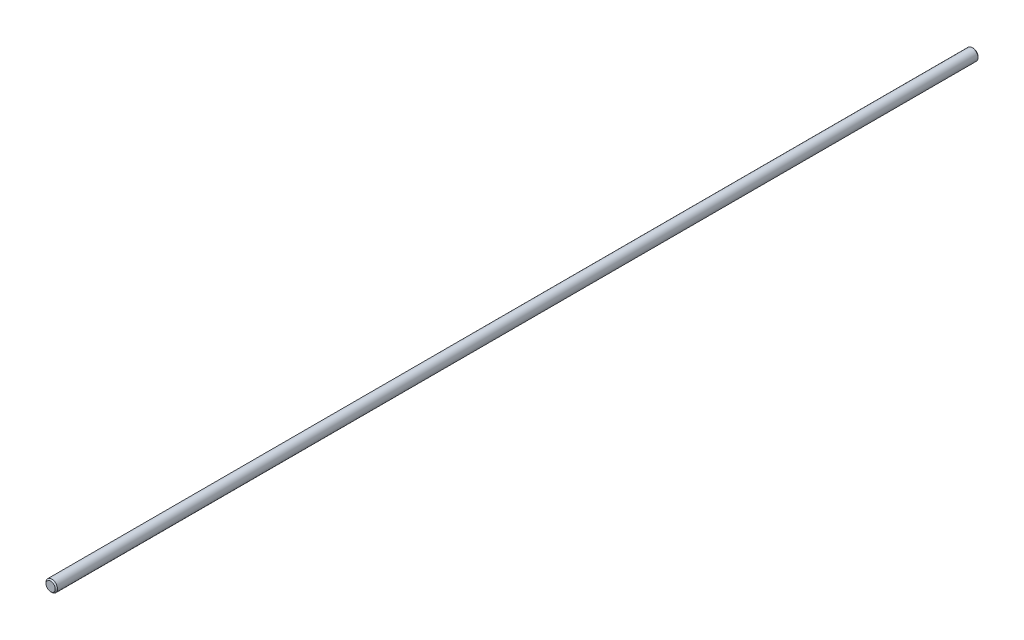
ISO-10303-21;
HEADER;
FILE_DESCRIPTION(('STEP AP214'),'2;1');
FILE_NAME('part.step','',(''),(''),'','','');
FILE_SCHEMA(('AUTOMOTIVE_DESIGN { 1 0 10303 214 1 1 1 1 }'));
ENDSEC;
DATA;
#1=APPLICATION_CONTEXT('core data for automotive mechanical design processes');
#2=APPLICATION_PROTOCOL_DEFINITION('international standard','automotive_design',2000,#1);
#3=PRODUCT_CONTEXT('',#1,'mechanical');
#4=PRODUCT('Part','Part','',(#3));
#5=PRODUCT_RELATED_PRODUCT_CATEGORY('part','',(#4));
#6=PRODUCT_DEFINITION_FORMATION('','',#4);
#7=PRODUCT_DEFINITION_CONTEXT('part definition',#1,'design');
#8=PRODUCT_DEFINITION('design','',#6,#7);
#9=PRODUCT_DEFINITION_SHAPE('','',#8);
#10=(LENGTH_UNIT() NAMED_UNIT(*) SI_UNIT(.MILLI.,.METRE.));
#11=(NAMED_UNIT(*) PLANE_ANGLE_UNIT() SI_UNIT($,.RADIAN.));
#12=(NAMED_UNIT(*) SI_UNIT($,.STERADIAN.) SOLID_ANGLE_UNIT());
#13=UNCERTAINTY_MEASURE_WITH_UNIT(LENGTH_MEASURE(1.E-05),#10,'distance_accuracy_value','');
#14=(GEOMETRIC_REPRESENTATION_CONTEXT(3) GLOBAL_UNCERTAINTY_ASSIGNED_CONTEXT((#13)) GLOBAL_UNIT_ASSIGNED_CONTEXT((#10,
#11,#12)) REPRESENTATION_CONTEXT('',''));
#15=CARTESIAN_POINT('',(0.,0.,0.));
#16=DIRECTION('',(0.,0.,1.));
#17=DIRECTION('',(1.,0.,0.));
#18=AXIS2_PLACEMENT_3D('',#15,#16,#17);
#19=CARTESIAN_POINT('',(0.,0.,200.));
#20=DIRECTION('',(0.,0.,-1.));
#21=DIRECTION('',(-1.,0.,0.));
#22=AXIS2_PLACEMENT_3D('',#19,#20,#21);
#23=CYLINDRICAL_SURFACE('',#22,2.5);
#24=CARTESIAN_POINT('',(0.,0.,-199.5));
#25=DIRECTION('',(0.,0.,1.));
#26=DIRECTION('',(1.,0.,0.));
#27=AXIS2_PLACEMENT_3D('',#24,#25,#26);
#28=CIRCLE('',#27,2.5);
#29=CARTESIAN_POINT('',(2.5,0.,-199.5));
#30=VERTEX_POINT('',#29);
#31=EDGE_CURVE('E41',#30,#30,#28,.T.);
#32=ORIENTED_EDGE('',*,*,#31,.T.);
#33=EDGE_LOOP('',(#32));
#34=FACE_BOUND('',#33,.T.);
#35=CARTESIAN_POINT('',(0.,0.,199.5));
#36=DIRECTION('',(0.,0.,1.));
#37=DIRECTION('',(1.,0.,0.));
#38=AXIS2_PLACEMENT_3D('',#35,#36,#37);
#39=CIRCLE('',#38,2.5);
#40=CARTESIAN_POINT('',(2.5,0.,199.5));
#41=VERTEX_POINT('',#40);
#42=EDGE_CURVE('E45',#41,#41,#39,.F.);
#43=ORIENTED_EDGE('',*,*,#42,.T.);
#44=EDGE_LOOP('',(#43));
#45=FACE_BOUND('',#44,.T.);
#46=ADVANCED_FACE('F30',(#34,#45),#23,.T.);
#47=CARTESIAN_POINT('',(0.,0.,200.));
#48=DIRECTION('',(0.,0.,1.));
#49=DIRECTION('',(1.,0.,0.));
#50=AXIS2_PLACEMENT_3D('',#47,#48,#49);
#51=PLANE('',#50);
#52=CARTESIAN_POINT('',(0.,0.,200.));
#53=DIRECTION('',(0.,0.,1.));
#54=DIRECTION('',(1.,0.,0.));
#55=AXIS2_PLACEMENT_3D('',#52,#53,#54);
#56=CIRCLE('',#55,2.);
#57=CARTESIAN_POINT('',(2.,0.,200.));
#58=VERTEX_POINT('',#57);
#59=EDGE_CURVE('E10',#58,#58,#56,.T.);
#60=ORIENTED_EDGE('',*,*,#59,.T.);
#61=EDGE_LOOP('',(#60));
#62=FACE_BOUND('',#61,.T.);
#63=ADVANCED_FACE('F61',(#62),#51,.T.);
#64=CARTESIAN_POINT('',(0.,0.,-200.));
#65=DIRECTION('',(0.,0.,1.));
#66=DIRECTION('',(1.,0.,0.));
#67=AXIS2_PLACEMENT_3D('',#64,#65,#66);
#68=PLANE('',#67);
#69=CARTESIAN_POINT('',(0.,0.,-200.));
#70=DIRECTION('',(0.,0.,1.));
#71=DIRECTION('',(1.,0.,0.));
#72=AXIS2_PLACEMENT_3D('',#69,#70,#71);
#73=CIRCLE('',#72,2.00000000000006);
#74=CARTESIAN_POINT('',(2.00000000000006,0.,-200.));
#75=VERTEX_POINT('',#74);
#76=EDGE_CURVE('E37',#75,#75,#73,.F.);
#77=ORIENTED_EDGE('',*,*,#76,.T.);
#78=EDGE_LOOP('',(#77));
#79=FACE_BOUND('',#78,.T.);
#80=ADVANCED_FACE('F58',(#79),#68,.F.);
#81=CARTESIAN_POINT('',(0.,0.,-199.5));
#82=DIRECTION('',(0.,0.,1.));
#83=DIRECTION('',(1.,0.,0.));
#84=AXIS2_PLACEMENT_3D('',#81,#82,#83);
#85=CONICAL_SURFACE('',#84,2.5,0.785398163397502);
#86=ORIENTED_EDGE('',*,*,#76,.F.);
#87=EDGE_LOOP('',(#86));
#88=FACE_BOUND('',#87,.T.);
#89=ORIENTED_EDGE('',*,*,#31,.F.);
#90=EDGE_LOOP('',(#89));
#91=FACE_BOUND('',#90,.T.);
#92=ADVANCED_FACE('F54',(#88,#91),#85,.T.);
#93=CARTESIAN_POINT('',(0.,0.,200.));
#94=DIRECTION('',(0.,0.,-1.));
#95=DIRECTION('',(-1.,0.,0.));
#96=AXIS2_PLACEMENT_3D('',#93,#94,#95);
#97=CONICAL_SURFACE('',#96,2.,0.785398163397391);
#98=ORIENTED_EDGE('',*,*,#42,.F.);
#99=EDGE_LOOP('',(#98));
#100=FACE_BOUND('',#99,.T.);
#101=ORIENTED_EDGE('',*,*,#59,.F.);
#102=EDGE_LOOP('',(#101));
#103=FACE_BOUND('',#102,.T.);
#104=ADVANCED_FACE('F32',(#100,#103),#97,.T.);
#105=CLOSED_SHELL('',(#46,#63,#80,#92,#104));
#106=MANIFOLD_SOLID_BREP('B2',#105);
#107=ADVANCED_BREP_SHAPE_REPRESENTATION('',(#18,#106),#14);
#108=SHAPE_DEFINITION_REPRESENTATION(#9,#107);
ENDSEC;
END-ISO-10303-21;
